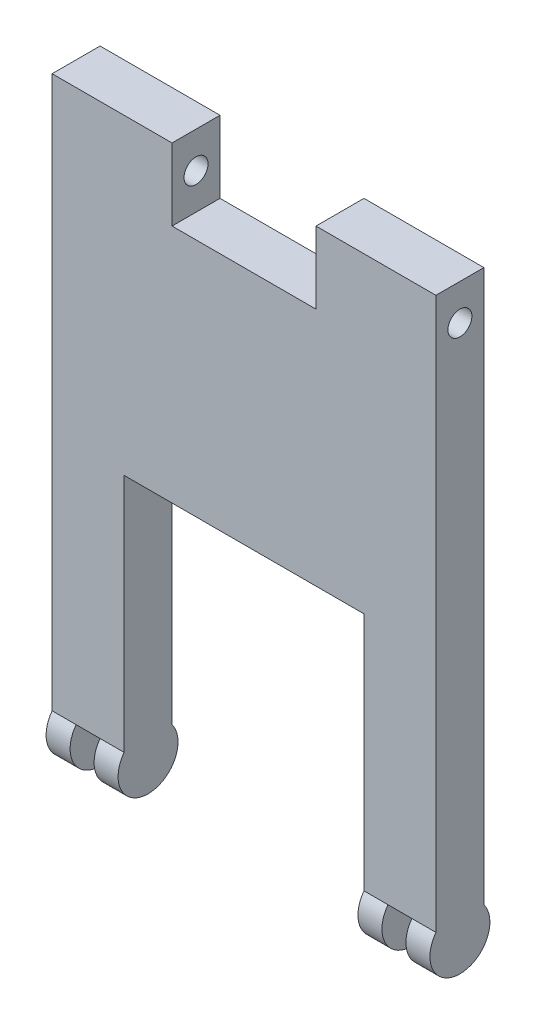
ISO-10303-21;
HEADER;
FILE_DESCRIPTION(('STEP AP214'),'2;1');
FILE_NAME('part.step','',(''),(''),'','','');
FILE_SCHEMA(('AUTOMOTIVE_DESIGN { 1 0 10303 214 1 1 1 1 }'));
ENDSEC;
DATA;
#1=APPLICATION_CONTEXT('core data for automotive mechanical design processes');
#2=APPLICATION_PROTOCOL_DEFINITION('international standard','automotive_design',2000,#1);
#3=PRODUCT_CONTEXT('',#1,'mechanical');
#4=PRODUCT('Part','Part','',(#3));
#5=PRODUCT_RELATED_PRODUCT_CATEGORY('part','',(#4));
#6=PRODUCT_DEFINITION_FORMATION('','',#4);
#7=PRODUCT_DEFINITION_CONTEXT('part definition',#1,'design');
#8=PRODUCT_DEFINITION('design','',#6,#7);
#9=PRODUCT_DEFINITION_SHAPE('','',#8);
#10=(LENGTH_UNIT() NAMED_UNIT(*) SI_UNIT(.MILLI.,.METRE.));
#11=(NAMED_UNIT(*) PLANE_ANGLE_UNIT() SI_UNIT($,.RADIAN.));
#12=(NAMED_UNIT(*) SI_UNIT($,.STERADIAN.) SOLID_ANGLE_UNIT());
#13=UNCERTAINTY_MEASURE_WITH_UNIT(LENGTH_MEASURE(1.E-05),#10,'distance_accuracy_value','');
#14=(GEOMETRIC_REPRESENTATION_CONTEXT(3) GLOBAL_UNCERTAINTY_ASSIGNED_CONTEXT((#13)) GLOBAL_UNIT_ASSIGNED_CONTEXT((#10,
#11,#12)) REPRESENTATION_CONTEXT('',''));
#15=CARTESIAN_POINT('',(0.,0.,0.));
#16=DIRECTION('',(0.,0.,1.));
#17=DIRECTION('',(1.,0.,0.));
#18=AXIS2_PLACEMENT_3D('',#15,#16,#17);
#19=CARTESIAN_POINT('',(-80.,115.,-20.));
#20=DIRECTION('',(0.,1.,0.));
#21=DIRECTION('',(-1.,0.,0.));
#22=AXIS2_PLACEMENT_3D('',#19,#20,#21);
#23=PLANE('',#22);
#24=DIRECTION('',(0.,0.,-1.));
#25=VECTOR('',#24,1.);
#26=CARTESIAN_POINT('',(30.,115.,0.));
#27=LINE('',#26,#25);
#28=CARTESIAN_POINT('',(30.,115.,0.));
#29=VERTEX_POINT('',#28);
#30=CARTESIAN_POINT('',(30.,115.,-20.));
#31=VERTEX_POINT('',#30);
#32=EDGE_CURVE('E153',#29,#31,#27,.T.);
#33=ORIENTED_EDGE('',*,*,#32,.F.);
#34=DIRECTION('',(-1.,0.,0.));
#35=VECTOR('',#34,1.);
#36=CARTESIAN_POINT('',(-80.,115.,0.));
#37=LINE('',#36,#35);
#38=CARTESIAN_POINT('',(80.,115.,0.));
#39=VERTEX_POINT('',#38);
#40=EDGE_CURVE('E247',#39,#29,#37,.T.);
#41=ORIENTED_EDGE('',*,*,#40,.F.);
#42=DIRECTION('',(0.,0.,1.));
#43=VECTOR('',#42,1.);
#44=CARTESIAN_POINT('',(80.,115.,-20.));
#45=LINE('',#44,#43);
#46=CARTESIAN_POINT('',(80.,115.,-20.));
#47=VERTEX_POINT('',#46);
#48=EDGE_CURVE('E242',#47,#39,#45,.T.);
#49=ORIENTED_EDGE('',*,*,#48,.F.);
#50=DIRECTION('',(-1.,0.,0.));
#51=VECTOR('',#50,1.);
#52=CARTESIAN_POINT('',(-80.,115.,-20.));
#53=LINE('',#52,#51);
#54=EDGE_CURVE('E222',#47,#31,#53,.T.);
#55=ORIENTED_EDGE('',*,*,#54,.T.);
#56=EDGE_LOOP('',(#33,#41,#49,#55));
#57=FACE_BOUND('',#56,.T.);
#58=ADVANCED_FACE('F32',(#57),#23,.T.);
#59=CARTESIAN_POINT('',(-80.001,100.,-10.));
#60=DIRECTION('',(1.,0.,0.));
#61=DIRECTION('',(0.,0.,-1.));
#62=AXIS2_PLACEMENT_3D('',#59,#60,#61);
#63=CYLINDRICAL_SURFACE('',#62,5.);
#64=CARTESIAN_POINT('',(30.,100.,-10.));
#65=DIRECTION('',(1.,0.,0.));
#66=DIRECTION('',(0.,1.,0.));
#67=AXIS2_PLACEMENT_3D('',#64,#65,#66);
#68=CIRCLE('',#67,5.);
#69=CARTESIAN_POINT('',(30.,105.,-10.));
#70=VERTEX_POINT('',#69);
#71=EDGE_CURVE('E36',#70,#70,#68,.F.);
#72=ORIENTED_EDGE('',*,*,#71,.T.);
#73=EDGE_LOOP('',(#72));
#74=FACE_BOUND('',#73,.T.);
#75=CARTESIAN_POINT('',(80.,100.,-10.));
#76=DIRECTION('',(1.,0.,0.));
#77=DIRECTION('',(0.,0.,-1.));
#78=AXIS2_PLACEMENT_3D('',#75,#76,#77);
#79=CIRCLE('',#78,5.);
#80=CARTESIAN_POINT('',(80.,100.,-15.));
#81=VERTEX_POINT('',#80);
#82=EDGE_CURVE('E183',#81,#81,#79,.T.);
#83=ORIENTED_EDGE('',*,*,#82,.T.);
#84=EDGE_LOOP('',(#83));
#85=FACE_BOUND('',#84,.T.);
#86=ADVANCED_FACE('F281',(#74,#85),#63,.F.);
#87=CARTESIAN_POINT('',(80.,-122.5,-10.));
#88=DIRECTION('',(-1.,0.,0.));
#89=DIRECTION('',(0.,0.,1.));
#90=AXIS2_PLACEMENT_3D('',#87,#88,#89);
#91=CYLINDRICAL_SURFACE('',#90,12.5);
#92=DIRECTION('',(1.,0.,0.));
#93=VECTOR('',#92,1.);
#94=CARTESIAN_POINT('',(-80.,-115.,-20.));
#95=LINE('',#94,#93);
#96=CARTESIAN_POINT('',(-70.,-115.,-20.));
#97=VERTEX_POINT('',#96);
#98=CARTESIAN_POINT('',(-60.,-115.,-20.));
#99=VERTEX_POINT('',#98);
#100=EDGE_CURVE('E227',#97,#99,#95,.T.);
#101=ORIENTED_EDGE('',*,*,#100,.T.);
#102=CARTESIAN_POINT('',(-60.,-122.5,-10.));
#103=DIRECTION('',(-1.,0.,0.));
#104=DIRECTION('',(0.,0.,1.));
#105=AXIS2_PLACEMENT_3D('',#102,#103,#104);
#106=CIRCLE('',#105,12.5);
#107=CARTESIAN_POINT('',(-60.,-115.,0.));
#108=VERTEX_POINT('',#107);
#109=EDGE_CURVE('E190',#108,#99,#106,.T.);
#110=ORIENTED_EDGE('',*,*,#109,.F.);
#111=DIRECTION('',(1.,0.,0.));
#112=VECTOR('',#111,1.);
#113=CARTESIAN_POINT('',(-80.,-115.,0.));
#114=LINE('',#113,#112);
#115=CARTESIAN_POINT('',(-70.,-115.,0.));
#116=VERTEX_POINT('',#115);
#117=EDGE_CURVE('E258',#116,#108,#114,.T.);
#118=ORIENTED_EDGE('',*,*,#117,.F.);
#119=CARTESIAN_POINT('',(-70.,-122.5,-10.));
#120=DIRECTION('',(1.,0.,0.));
#121=DIRECTION('',(0.,0.,-1.));
#122=AXIS2_PLACEMENT_3D('',#119,#120,#121);
#123=CIRCLE('',#122,12.5);
#124=EDGE_CURVE('E204',#97,#116,#123,.T.);
#125=ORIENTED_EDGE('',*,*,#124,.F.);
#126=EDGE_LOOP('',(#101,#110,#118,#125));
#127=FACE_BOUND('',#126,.T.);
#128=ADVANCED_FACE('F301',(#127),#91,.F.);
#129=DIRECTION('',(1.,0.,0.));
#130=VECTOR('',#129,1.);
#131=CARTESIAN_POINT('',(50.,-115.,0.));
#132=LINE('',#131,#130);
#133=CARTESIAN_POINT('',(60.,-115.,0.));
#134=VERTEX_POINT('',#133);
#135=CARTESIAN_POINT('',(70.,-115.,0.));
#136=VERTEX_POINT('',#135);
#137=EDGE_CURVE('E269',#134,#136,#132,.T.);
#138=ORIENTED_EDGE('',*,*,#137,.F.);
#139=CARTESIAN_POINT('',(60.,-122.5,-10.));
#140=DIRECTION('',(-1.,0.,0.));
#141=DIRECTION('',(0.,0.,1.));
#142=AXIS2_PLACEMENT_3D('',#139,#140,#141);
#143=CIRCLE('',#142,12.5);
#144=CARTESIAN_POINT('',(60.,-115.,-20.));
#145=VERTEX_POINT('',#144);
#146=EDGE_CURVE('E56',#134,#145,#143,.T.);
#147=ORIENTED_EDGE('',*,*,#146,.T.);
#148=DIRECTION('',(1.,0.,0.));
#149=VECTOR('',#148,1.);
#150=CARTESIAN_POINT('',(50.,-115.,-20.));
#151=LINE('',#150,#149);
#152=CARTESIAN_POINT('',(70.,-115.,-20.));
#153=VERTEX_POINT('',#152);
#154=EDGE_CURVE('E243',#145,#153,#151,.T.);
#155=ORIENTED_EDGE('',*,*,#154,.T.);
#156=CARTESIAN_POINT('',(70.,-122.5,-10.));
#157=DIRECTION('',(1.,0.,0.));
#158=DIRECTION('',(0.,0.,-1.));
#159=AXIS2_PLACEMENT_3D('',#156,#157,#158);
#160=CIRCLE('',#159,12.5);
#161=EDGE_CURVE('E210',#153,#136,#160,.T.);
#162=ORIENTED_EDGE('',*,*,#161,.T.);
#163=EDGE_LOOP('',(#138,#147,#155,#162));
#164=FACE_BOUND('',#163,.T.);
#165=ADVANCED_FACE('F341',(#164),#91,.F.);
#166=CARTESIAN_POINT('',(80.,-115.,-20.));
#167=DIRECTION('',(1.,0.,0.));
#168=DIRECTION('',(0.,0.,-1.));
#169=AXIS2_PLACEMENT_3D('',#166,#167,#168);
#170=PLANE('',#169);
#171=ORIENTED_EDGE('',*,*,#82,.F.);
#172=EDGE_LOOP('',(#171));
#173=FACE_BOUND('',#172,.T.);
#174=DIRECTION('',(0.,1.,0.));
#175=VECTOR('',#174,1.);
#176=CARTESIAN_POINT('',(80.,-115.,0.));
#177=LINE('',#176,#175);
#178=CARTESIAN_POINT('',(80.,-115.,0.));
#179=VERTEX_POINT('',#178);
#180=EDGE_CURVE('E213',#179,#39,#177,.T.);
#181=ORIENTED_EDGE('',*,*,#180,.F.);
#182=CARTESIAN_POINT('',(80.,-122.5,-10.));
#183=DIRECTION('',(1.,0.,0.));
#184=DIRECTION('',(0.,0.,-1.));
#185=AXIS2_PLACEMENT_3D('',#182,#183,#184);
#186=CIRCLE('',#185,12.5);
#187=CARTESIAN_POINT('',(80.,-115.,-20.));
#188=VERTEX_POINT('',#187);
#189=EDGE_CURVE('E207',#179,#188,#186,.T.);
#190=ORIENTED_EDGE('',*,*,#189,.T.);
#191=DIRECTION('',(0.,1.,0.));
#192=VECTOR('',#191,1.);
#193=CARTESIAN_POINT('',(80.,-115.,-20.));
#194=LINE('',#193,#192);
#195=EDGE_CURVE('E217',#188,#47,#194,.T.);
#196=ORIENTED_EDGE('',*,*,#195,.T.);
#197=ORIENTED_EDGE('',*,*,#48,.T.);
#198=EDGE_LOOP('',(#181,#190,#196,#197));
#199=FACE_BOUND('',#198,.T.);
#200=ADVANCED_FACE('F34',(#173,#199),#170,.T.);
#201=CARTESIAN_POINT('',(50.,-115.,-20.));
#202=DIRECTION('',(-1.,0.,0.));
#203=DIRECTION('',(0.,0.,1.));
#204=AXIS2_PLACEMENT_3D('',#201,#202,#203);
#205=PLANE('',#204);
#206=DIRECTION('',(0.,-1.,0.));
#207=VECTOR('',#206,1.);
#208=CARTESIAN_POINT('',(50.,-115.,-20.));
#209=LINE('',#208,#207);
#210=CARTESIAN_POINT('',(50.,-15.,-20.));
#211=VERTEX_POINT('',#210);
#212=CARTESIAN_POINT('',(50.,-115.,-20.));
#213=VERTEX_POINT('',#212);
#214=EDGE_CURVE('E236',#211,#213,#209,.T.);
#215=ORIENTED_EDGE('',*,*,#214,.T.);
#216=CARTESIAN_POINT('',(50.,-122.5,-10.));
#217=DIRECTION('',(-1.,0.,0.));
#218=DIRECTION('',(0.,0.,1.));
#219=AXIS2_PLACEMENT_3D('',#216,#217,#218);
#220=CIRCLE('',#219,12.5);
#221=CARTESIAN_POINT('',(50.,-115.,0.));
#222=VERTEX_POINT('',#221);
#223=EDGE_CURVE('E198',#213,#222,#220,.T.);
#224=ORIENTED_EDGE('',*,*,#223,.T.);
#225=DIRECTION('',(0.,-1.,0.));
#226=VECTOR('',#225,1.);
#227=CARTESIAN_POINT('',(50.,-115.,0.));
#228=LINE('',#227,#226);
#229=CARTESIAN_POINT('',(50.,-15.,0.));
#230=VERTEX_POINT('',#229);
#231=EDGE_CURVE('E264',#230,#222,#228,.T.);
#232=ORIENTED_EDGE('',*,*,#231,.F.);
#233=DIRECTION('',(0.,0.,1.));
#234=VECTOR('',#233,1.);
#235=CARTESIAN_POINT('',(50.,-15.,-20.));
#236=LINE('',#235,#234);
#237=EDGE_CURVE('E11',#211,#230,#236,.T.);
#238=ORIENTED_EDGE('',*,*,#237,.F.);
#239=EDGE_LOOP('',(#215,#224,#232,#238));
#240=FACE_BOUND('',#239,.T.);
#241=ADVANCED_FACE('F379',(#240),#205,.T.);
#242=CARTESIAN_POINT('',(-50.,-15.,-20.));
#243=DIRECTION('',(0.,-1.,0.));
#244=DIRECTION('',(0.,0.,-1.));
#245=AXIS2_PLACEMENT_3D('',#242,#243,#244);
#246=PLANE('',#245);
#247=DIRECTION('',(1.,0.,0.));
#248=VECTOR('',#247,1.);
#249=CARTESIAN_POINT('',(-50.,-15.,0.));
#250=LINE('',#249,#248);
#251=CARTESIAN_POINT('',(-50.,-15.,0.));
#252=VERTEX_POINT('',#251);
#253=EDGE_CURVE('E261',#252,#230,#250,.T.);
#254=ORIENTED_EDGE('',*,*,#253,.F.);
#255=DIRECTION('',(0.,0.,1.));
#256=VECTOR('',#255,1.);
#257=CARTESIAN_POINT('',(-50.,-15.,-20.));
#258=LINE('',#257,#256);
#259=CARTESIAN_POINT('',(-50.,-15.,-20.));
#260=VERTEX_POINT('',#259);
#261=EDGE_CURVE('E41',#260,#252,#258,.T.);
#262=ORIENTED_EDGE('',*,*,#261,.F.);
#263=DIRECTION('',(1.,0.,0.));
#264=VECTOR('',#263,1.);
#265=CARTESIAN_POINT('',(-50.,-15.,-20.));
#266=LINE('',#265,#264);
#267=EDGE_CURVE('E233',#260,#211,#266,.T.);
#268=ORIENTED_EDGE('',*,*,#267,.T.);
#269=ORIENTED_EDGE('',*,*,#237,.T.);
#270=EDGE_LOOP('',(#254,#262,#268,#269));
#271=FACE_BOUND('',#270,.T.);
#272=ADVANCED_FACE('F382',(#271),#246,.T.);
#273=CARTESIAN_POINT('',(-50.,-115.,-20.));
#274=DIRECTION('',(1.,0.,0.));
#275=DIRECTION('',(0.,0.,-1.));
#276=AXIS2_PLACEMENT_3D('',#273,#274,#275);
#277=PLANE('',#276);
#278=DIRECTION('',(0.,1.,0.));
#279=VECTOR('',#278,1.);
#280=CARTESIAN_POINT('',(-50.,-115.,0.));
#281=LINE('',#280,#279);
#282=CARTESIAN_POINT('',(-50.,-115.,0.));
#283=VERTEX_POINT('',#282);
#284=EDGE_CURVE('E257',#283,#252,#281,.T.);
#285=ORIENTED_EDGE('',*,*,#284,.F.);
#286=CARTESIAN_POINT('',(-50.,-122.5,-10.));
#287=DIRECTION('',(-1.,0.,0.));
#288=DIRECTION('',(0.,0.,1.));
#289=AXIS2_PLACEMENT_3D('',#286,#287,#288);
#290=CIRCLE('',#289,12.5);
#291=CARTESIAN_POINT('',(-50.,-115.,-20.));
#292=VERTEX_POINT('',#291);
#293=EDGE_CURVE('E186',#292,#283,#290,.T.);
#294=ORIENTED_EDGE('',*,*,#293,.F.);
#295=DIRECTION('',(0.,1.,0.));
#296=VECTOR('',#295,1.);
#297=CARTESIAN_POINT('',(-50.,-115.,-20.));
#298=LINE('',#297,#296);
#299=EDGE_CURVE('E230',#292,#260,#298,.T.);
#300=ORIENTED_EDGE('',*,*,#299,.T.);
#301=ORIENTED_EDGE('',*,*,#261,.T.);
#302=EDGE_LOOP('',(#285,#294,#300,#301));
#303=FACE_BOUND('',#302,.T.);
#304=ADVANCED_FACE('F312',(#303),#277,.T.);
#305=CARTESIAN_POINT('',(-80.,-115.,-20.));
#306=DIRECTION('',(-1.,0.,0.));
#307=DIRECTION('',(0.,0.,1.));
#308=AXIS2_PLACEMENT_3D('',#305,#306,#307);
#309=PLANE('',#308);
#310=CARTESIAN_POINT('',(-80.,100.,-10.));
#311=DIRECTION('',(-1.,0.,0.));
#312=DIRECTION('',(0.,0.,1.));
#313=AXIS2_PLACEMENT_3D('',#310,#311,#312);
#314=CIRCLE('',#313,5.);
#315=CARTESIAN_POINT('',(-80.,100.,-5.));
#316=VERTEX_POINT('',#315);
#317=EDGE_CURVE('E187',#316,#316,#314,.F.);
#318=ORIENTED_EDGE('',*,*,#317,.T.);
#319=EDGE_LOOP('',(#318));
#320=FACE_BOUND('',#319,.T.);
#321=DIRECTION('',(0.,-1.,0.));
#322=VECTOR('',#321,1.);
#323=CARTESIAN_POINT('',(-80.,-115.,-20.));
#324=LINE('',#323,#322);
#325=CARTESIAN_POINT('',(-80.,115.,-20.));
#326=VERTEX_POINT('',#325);
#327=CARTESIAN_POINT('',(-80.,-115.,-20.));
#328=VERTEX_POINT('',#327);
#329=EDGE_CURVE('E224',#326,#328,#324,.T.);
#330=ORIENTED_EDGE('',*,*,#329,.T.);
#331=CARTESIAN_POINT('',(-80.,-122.5,-10.));
#332=DIRECTION('',(1.,0.,0.));
#333=DIRECTION('',(0.,0.,-1.));
#334=AXIS2_PLACEMENT_3D('',#331,#332,#333);
#335=CIRCLE('',#334,12.5);
#336=CARTESIAN_POINT('',(-80.,-115.,0.));
#337=VERTEX_POINT('',#336);
#338=EDGE_CURVE('E200',#337,#328,#335,.T.);
#339=ORIENTED_EDGE('',*,*,#338,.F.);
#340=DIRECTION('',(0.,-1.,0.));
#341=VECTOR('',#340,1.);
#342=CARTESIAN_POINT('',(-80.,-115.,0.));
#343=LINE('',#342,#341);
#344=CARTESIAN_POINT('',(-80.,115.,0.));
#345=VERTEX_POINT('',#344);
#346=EDGE_CURVE('E250',#345,#337,#343,.T.);
#347=ORIENTED_EDGE('',*,*,#346,.F.);
#348=DIRECTION('',(0.,0.,1.));
#349=VECTOR('',#348,1.);
#350=CARTESIAN_POINT('',(-80.,115.,-20.));
#351=LINE('',#350,#349);
#352=EDGE_CURVE('E272',#326,#345,#351,.T.);
#353=ORIENTED_EDGE('',*,*,#352,.F.);
#354=EDGE_LOOP('',(#330,#339,#347,#353));
#355=FACE_BOUND('',#354,.T.);
#356=ADVANCED_FACE('F304',(#320,#355),#309,.T.);
#357=DIRECTION('',(0.,0.,1.));
#358=VECTOR('',#357,1.);
#359=CARTESIAN_POINT('',(-30.,115.,0.));
#360=LINE('',#359,#358);
#361=CARTESIAN_POINT('',(-30.,115.,-20.));
#362=VERTEX_POINT('',#361);
#363=CARTESIAN_POINT('',(-30.,115.,0.));
#364=VERTEX_POINT('',#363);
#365=EDGE_CURVE('E166',#362,#364,#360,.T.);
#366=ORIENTED_EDGE('',*,*,#365,.F.);
#367=EDGE_CURVE('E220',#362,#326,#53,.T.);
#368=ORIENTED_EDGE('',*,*,#367,.T.);
#369=ORIENTED_EDGE('',*,*,#352,.T.);
#370=EDGE_CURVE('E246',#364,#345,#37,.T.);
#371=ORIENTED_EDGE('',*,*,#370,.F.);
#372=EDGE_LOOP('',(#366,#368,#369,#371));
#373=FACE_BOUND('',#372,.T.);
#374=ADVANCED_FACE('F297',(#373),#23,.T.);
#375=CARTESIAN_POINT('',(0.,0.,-20.));
#376=DIRECTION('',(0.,0.,-1.));
#377=DIRECTION('',(-1.,0.,0.));
#378=AXIS2_PLACEMENT_3D('',#375,#376,#377);
#379=PLANE('',#378);
#380=DIRECTION('',(0.,1.,0.));
#381=VECTOR('',#380,1.);
#382=CARTESIAN_POINT('',(30.,85.,-20.));
#383=LINE('',#382,#381);
#384=CARTESIAN_POINT('',(30.,85.,-20.));
#385=VERTEX_POINT('',#384);
#386=EDGE_CURVE('E147',#385,#31,#383,.T.);
#387=ORIENTED_EDGE('',*,*,#386,.T.);
#388=ORIENTED_EDGE('',*,*,#54,.F.);
#389=ORIENTED_EDGE('',*,*,#195,.F.);
#390=EDGE_CURVE('E239',#153,#188,#151,.T.);
#391=ORIENTED_EDGE('',*,*,#390,.F.);
#392=ORIENTED_EDGE('',*,*,#154,.F.);
#393=EDGE_CURVE('E240',#213,#145,#151,.T.);
#394=ORIENTED_EDGE('',*,*,#393,.F.);
#395=ORIENTED_EDGE('',*,*,#214,.F.);
#396=ORIENTED_EDGE('',*,*,#267,.F.);
#397=ORIENTED_EDGE('',*,*,#299,.F.);
#398=DIRECTION('',(1.,0.,0.));
#399=VECTOR('',#398,1.);
#400=CARTESIAN_POINT('',(-60.,-115.,-20.));
#401=LINE('',#400,#399);
#402=EDGE_CURVE('E193',#292,#99,#401,.F.);
#403=ORIENTED_EDGE('',*,*,#402,.T.);
#404=ORIENTED_EDGE('',*,*,#100,.F.);
#405=EDGE_CURVE('E228',#328,#97,#95,.T.);
#406=ORIENTED_EDGE('',*,*,#405,.F.);
#407=ORIENTED_EDGE('',*,*,#329,.F.);
#408=ORIENTED_EDGE('',*,*,#367,.F.);
#409=DIRECTION('',(0.,1.,0.));
#410=VECTOR('',#409,1.);
#411=CARTESIAN_POINT('',(-30.,85.,-20.));
#412=LINE('',#411,#410);
#413=CARTESIAN_POINT('',(-30.,85.,-20.));
#414=VERTEX_POINT('',#413);
#415=EDGE_CURVE('E158',#414,#362,#412,.T.);
#416=ORIENTED_EDGE('',*,*,#415,.F.);
#417=DIRECTION('',(-1.,0.,0.));
#418=VECTOR('',#417,1.);
#419=CARTESIAN_POINT('',(-30.,85.,-20.));
#420=LINE('',#419,#418);
#421=EDGE_CURVE('E162',#385,#414,#420,.T.);
#422=ORIENTED_EDGE('',*,*,#421,.F.);
#423=EDGE_LOOP('',(#387,#388,#389,#391,#392,#394,#395,#396,#397,#403,#404,#406,#407,#408,#416,#422));
#424=FACE_BOUND('',#423,.T.);
#425=ADVANCED_FACE('F168',(#424),#379,.T.);
#426=CARTESIAN_POINT('',(0.,0.,0.));
#427=DIRECTION('',(0.,0.,-1.));
#428=DIRECTION('',(-1.,0.,0.));
#429=AXIS2_PLACEMENT_3D('',#426,#427,#428);
#430=PLANE('',#429);
#431=ORIENTED_EDGE('',*,*,#40,.T.);
#432=DIRECTION('',(0.,1.,0.));
#433=VECTOR('',#432,1.);
#434=CARTESIAN_POINT('',(30.,85.,0.));
#435=LINE('',#434,#433);
#436=CARTESIAN_POINT('',(30.,85.,0.));
#437=VERTEX_POINT('',#436);
#438=EDGE_CURVE('E176',#437,#29,#435,.T.);
#439=ORIENTED_EDGE('',*,*,#438,.F.);
#440=DIRECTION('',(1.,0.,0.));
#441=VECTOR('',#440,1.);
#442=CARTESIAN_POINT('',(-30.,85.,0.));
#443=LINE('',#442,#441);
#444=CARTESIAN_POINT('',(-30.,85.,0.));
#445=VERTEX_POINT('',#444);
#446=EDGE_CURVE('E159',#445,#437,#443,.T.);
#447=ORIENTED_EDGE('',*,*,#446,.F.);
#448=DIRECTION('',(0.,1.,0.));
#449=VECTOR('',#448,1.);
#450=CARTESIAN_POINT('',(-30.,85.,0.));
#451=LINE('',#450,#449);
#452=EDGE_CURVE('E179',#445,#364,#451,.T.);
#453=ORIENTED_EDGE('',*,*,#452,.T.);
#454=ORIENTED_EDGE('',*,*,#370,.T.);
#455=ORIENTED_EDGE('',*,*,#346,.T.);
#456=EDGE_CURVE('E254',#337,#116,#114,.T.);
#457=ORIENTED_EDGE('',*,*,#456,.T.);
#458=ORIENTED_EDGE('',*,*,#117,.T.);
#459=EDGE_CURVE('E253',#108,#283,#114,.T.);
#460=ORIENTED_EDGE('',*,*,#459,.T.);
#461=ORIENTED_EDGE('',*,*,#284,.T.);
#462=ORIENTED_EDGE('',*,*,#253,.T.);
#463=ORIENTED_EDGE('',*,*,#231,.T.);
#464=EDGE_CURVE('E221',#222,#134,#132,.T.);
#465=ORIENTED_EDGE('',*,*,#464,.T.);
#466=ORIENTED_EDGE('',*,*,#137,.T.);
#467=EDGE_CURVE('E267',#136,#179,#132,.T.);
#468=ORIENTED_EDGE('',*,*,#467,.T.);
#469=ORIENTED_EDGE('',*,*,#180,.T.);
#470=EDGE_LOOP('',(#431,#439,#447,#453,#454,#455,#457,#458,#460,#461,#462,#463,#465,#466,#468,#469));
#471=FACE_BOUND('',#470,.T.);
#472=ADVANCED_FACE('F310',(#471),#430,.F.);
#473=CARTESIAN_POINT('',(70.,-122.5,-10.));
#474=DIRECTION('',(1.,0.,0.));
#475=DIRECTION('',(0.,0.,-1.));
#476=AXIS2_PLACEMENT_3D('',#473,#474,#475);
#477=CYLINDRICAL_SURFACE('',#476,12.5);
#478=EDGE_CURVE('E214',#136,#153,#160,.T.);
#479=ORIENTED_EDGE('',*,*,#478,.T.);
#480=ORIENTED_EDGE('',*,*,#390,.T.);
#481=ORIENTED_EDGE('',*,*,#189,.F.);
#482=ORIENTED_EDGE('',*,*,#467,.F.);
#483=EDGE_LOOP('',(#479,#480,#481,#482));
#484=FACE_BOUND('',#483,.T.);
#485=ADVANCED_FACE('F335',(#484),#477,.T.);
#486=CARTESIAN_POINT('',(70.,-122.5,-10.));
#487=DIRECTION('',(1.,0.,0.));
#488=DIRECTION('',(0.,0.,-1.));
#489=AXIS2_PLACEMENT_3D('',#486,#487,#488);
#490=PLANE('',#489);
#491=ORIENTED_EDGE('',*,*,#161,.F.);
#492=ORIENTED_EDGE('',*,*,#478,.F.);
#493=EDGE_LOOP('',(#491,#492));
#494=FACE_BOUND('',#493,.T.);
#495=ADVANCED_FACE('F367',(#494),#490,.F.);
#496=CARTESIAN_POINT('',(-70.,-122.5,-10.));
#497=DIRECTION('',(-1.,0.,0.));
#498=DIRECTION('',(0.,0.,1.));
#499=AXIS2_PLACEMENT_3D('',#496,#497,#498);
#500=CYLINDRICAL_SURFACE('',#499,12.5);
#501=ORIENTED_EDGE('',*,*,#405,.T.);
#502=EDGE_CURVE('E208',#116,#97,#123,.T.);
#503=ORIENTED_EDGE('',*,*,#502,.F.);
#504=ORIENTED_EDGE('',*,*,#456,.F.);
#505=ORIENTED_EDGE('',*,*,#338,.T.);
#506=EDGE_LOOP('',(#501,#503,#504,#505));
#507=FACE_BOUND('',#506,.T.);
#508=ADVANCED_FACE('F363',(#507),#500,.T.);
#509=CARTESIAN_POINT('',(-70.,-122.5,-10.));
#510=DIRECTION('',(-1.,0.,0.));
#511=DIRECTION('',(0.,0.,-1.));
#512=AXIS2_PLACEMENT_3D('',#509,#510,#511);
#513=PLANE('',#512);
#514=ORIENTED_EDGE('',*,*,#124,.T.);
#515=ORIENTED_EDGE('',*,*,#502,.T.);
#516=EDGE_LOOP('',(#514,#515));
#517=FACE_BOUND('',#516,.T.);
#518=ADVANCED_FACE('F357',(#517),#513,.F.);
#519=CARTESIAN_POINT('',(60.,-122.5,-10.));
#520=DIRECTION('',(-1.,0.,0.));
#521=DIRECTION('',(0.,0.,1.));
#522=AXIS2_PLACEMENT_3D('',#519,#520,#521);
#523=CYLINDRICAL_SURFACE('',#522,12.5);
#524=ORIENTED_EDGE('',*,*,#223,.F.);
#525=ORIENTED_EDGE('',*,*,#393,.T.);
#526=EDGE_CURVE('E201',#145,#134,#143,.T.);
#527=ORIENTED_EDGE('',*,*,#526,.T.);
#528=ORIENTED_EDGE('',*,*,#464,.F.);
#529=EDGE_LOOP('',(#524,#525,#527,#528));
#530=FACE_BOUND('',#529,.T.);
#531=ADVANCED_FACE('F346',(#530),#523,.T.);
#532=CARTESIAN_POINT('',(60.,-122.5,-10.));
#533=DIRECTION('',(-1.,0.,0.));
#534=DIRECTION('',(0.,0.,1.));
#535=AXIS2_PLACEMENT_3D('',#532,#533,#534);
#536=PLANE('',#535);
#537=ORIENTED_EDGE('',*,*,#146,.F.);
#538=ORIENTED_EDGE('',*,*,#526,.F.);
#539=EDGE_LOOP('',(#537,#538));
#540=FACE_BOUND('',#539,.T.);
#541=ADVANCED_FACE('F347',(#540),#536,.F.);
#542=CARTESIAN_POINT('',(-60.,-122.5,-10.));
#543=DIRECTION('',(1.,0.,0.));
#544=DIRECTION('',(0.,0.,-1.));
#545=AXIS2_PLACEMENT_3D('',#542,#543,#544);
#546=CYLINDRICAL_SURFACE('',#545,12.5);
#547=ORIENTED_EDGE('',*,*,#402,.F.);
#548=ORIENTED_EDGE('',*,*,#293,.T.);
#549=ORIENTED_EDGE('',*,*,#459,.F.);
#550=EDGE_CURVE('E194',#99,#108,#106,.T.);
#551=ORIENTED_EDGE('',*,*,#550,.F.);
#552=EDGE_LOOP('',(#547,#548,#549,#551));
#553=FACE_BOUND('',#552,.T.);
#554=ADVANCED_FACE('F349',(#553),#546,.T.);
#555=CARTESIAN_POINT('',(-60.,-122.5,-10.));
#556=DIRECTION('',(1.,0.,0.));
#557=DIRECTION('',(0.,0.,1.));
#558=AXIS2_PLACEMENT_3D('',#555,#556,#557);
#559=PLANE('',#558);
#560=ORIENTED_EDGE('',*,*,#109,.T.);
#561=ORIENTED_EDGE('',*,*,#550,.T.);
#562=EDGE_LOOP('',(#560,#561));
#563=FACE_BOUND('',#562,.T.);
#564=ADVANCED_FACE('F293',(#563),#559,.F.);
#565=CARTESIAN_POINT('',(-30.,100.,-10.));
#566=DIRECTION('',(-1.,0.,0.));
#567=DIRECTION('',(0.,-1.,0.));
#568=AXIS2_PLACEMENT_3D('',#565,#566,#567);
#569=CIRCLE('',#568,5.);
#570=CARTESIAN_POINT('',(-30.,95.,-10.));
#571=VERTEX_POINT('',#570);
#572=EDGE_CURVE('E178',#571,#571,#569,.F.);
#573=ORIENTED_EDGE('',*,*,#572,.T.);
#574=EDGE_LOOP('',(#573));
#575=FACE_BOUND('',#574,.T.);
#576=ORIENTED_EDGE('',*,*,#317,.F.);
#577=EDGE_LOOP('',(#576));
#578=FACE_BOUND('',#577,.T.);
#579=ADVANCED_FACE('F285',(#575,#578),#63,.F.);
#580=CARTESIAN_POINT('',(30.,85.,0.));
#581=DIRECTION('',(1.,0.,0.));
#582=DIRECTION('',(0.,1.,0.));
#583=AXIS2_PLACEMENT_3D('',#580,#581,#582);
#584=PLANE('',#583);
#585=ORIENTED_EDGE('',*,*,#32,.T.);
#586=ORIENTED_EDGE('',*,*,#386,.F.);
#587=DIRECTION('',(0.,0.,-1.));
#588=VECTOR('',#587,1.);
#589=CARTESIAN_POINT('',(30.,85.,0.));
#590=LINE('',#589,#588);
#591=EDGE_CURVE('E151',#437,#385,#590,.T.);
#592=ORIENTED_EDGE('',*,*,#591,.F.);
#593=ORIENTED_EDGE('',*,*,#438,.T.);
#594=EDGE_LOOP('',(#585,#586,#592,#593));
#595=FACE_BOUND('',#594,.T.);
#596=ORIENTED_EDGE('',*,*,#71,.F.);
#597=EDGE_LOOP('',(#596));
#598=FACE_BOUND('',#597,.T.);
#599=ADVANCED_FACE('F149',(#595,#598),#584,.F.);
#600=CARTESIAN_POINT('',(-30.,85.,0.));
#601=DIRECTION('',(-1.,0.,0.));
#602=DIRECTION('',(0.,-1.,0.));
#603=AXIS2_PLACEMENT_3D('',#600,#601,#602);
#604=PLANE('',#603);
#605=ORIENTED_EDGE('',*,*,#365,.T.);
#606=ORIENTED_EDGE('',*,*,#452,.F.);
#607=DIRECTION('',(0.,0.,1.));
#608=VECTOR('',#607,1.);
#609=CARTESIAN_POINT('',(-30.,85.,0.));
#610=LINE('',#609,#608);
#611=EDGE_CURVE('E49',#414,#445,#610,.T.);
#612=ORIENTED_EDGE('',*,*,#611,.F.);
#613=ORIENTED_EDGE('',*,*,#415,.T.);
#614=EDGE_LOOP('',(#605,#606,#612,#613));
#615=FACE_BOUND('',#614,.T.);
#616=ORIENTED_EDGE('',*,*,#572,.F.);
#617=EDGE_LOOP('',(#616));
#618=FACE_BOUND('',#617,.T.);
#619=ADVANCED_FACE('F284',(#615,#618),#604,.F.);
#620=CARTESIAN_POINT('',(0.,85.,0.));
#621=DIRECTION('',(0.,-1.,0.));
#622=DIRECTION('',(0.,0.,-1.));
#623=AXIS2_PLACEMENT_3D('',#620,#621,#622);
#624=PLANE('',#623);
#625=ORIENTED_EDGE('',*,*,#591,.T.);
#626=ORIENTED_EDGE('',*,*,#421,.T.);
#627=ORIENTED_EDGE('',*,*,#611,.T.);
#628=ORIENTED_EDGE('',*,*,#446,.T.);
#629=EDGE_LOOP('',(#625,#626,#627,#628));
#630=FACE_BOUND('',#629,.T.);
#631=ADVANCED_FACE('F161',(#630),#624,.F.);
#632=CLOSED_SHELL('',(#58,#86,#128,#165,#200,#241,#272,#304,#356,#374,#425,#472,#485,#495,#508,
#518,#531,#541,#554,#564,#579,#599,#619,#631));
#633=MANIFOLD_SOLID_BREP('B2',#632);
#634=ADVANCED_BREP_SHAPE_REPRESENTATION('',(#18,#633),#14);
#635=SHAPE_DEFINITION_REPRESENTATION(#9,#634);
ENDSEC;
END-ISO-10303-21;
